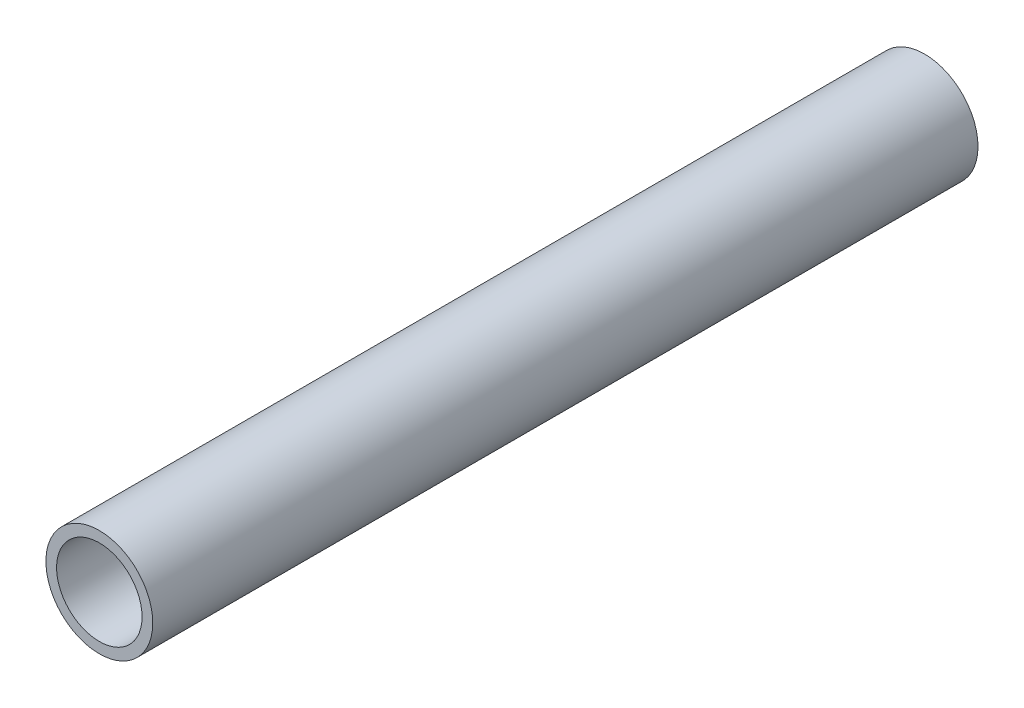
ISO-10303-21;
HEADER;
FILE_DESCRIPTION(('STEP AP214'),'2;1');
FILE_NAME('part.step','',(''),(''),'','','');
FILE_SCHEMA(('AUTOMOTIVE_DESIGN { 1 0 10303 214 1 1 1 1 }'));
ENDSEC;
DATA;
#1=APPLICATION_CONTEXT('core data for automotive mechanical design processes');
#2=APPLICATION_PROTOCOL_DEFINITION('international standard','automotive_design',2000,#1);
#3=PRODUCT_CONTEXT('',#1,'mechanical');
#4=PRODUCT('Part','Part','',(#3));
#5=PRODUCT_RELATED_PRODUCT_CATEGORY('part','',(#4));
#6=PRODUCT_DEFINITION_FORMATION('','',#4);
#7=PRODUCT_DEFINITION_CONTEXT('part definition',#1,'design');
#8=PRODUCT_DEFINITION('design','',#6,#7);
#9=PRODUCT_DEFINITION_SHAPE('','',#8);
#10=(LENGTH_UNIT() NAMED_UNIT(*) SI_UNIT(.MILLI.,.METRE.));
#11=(NAMED_UNIT(*) PLANE_ANGLE_UNIT() SI_UNIT($,.RADIAN.));
#12=(NAMED_UNIT(*) SI_UNIT($,.STERADIAN.) SOLID_ANGLE_UNIT());
#13=UNCERTAINTY_MEASURE_WITH_UNIT(LENGTH_MEASURE(1.E-05),#10,'distance_accuracy_value','');
#14=(GEOMETRIC_REPRESENTATION_CONTEXT(3) GLOBAL_UNCERTAINTY_ASSIGNED_CONTEXT((#13)) GLOBAL_UNIT_ASSIGNED_CONTEXT((#10,
#11,#12)) REPRESENTATION_CONTEXT('',''));
#15=CARTESIAN_POINT('',(0.,0.,0.));
#16=DIRECTION('',(0.,0.,1.));
#17=DIRECTION('',(1.,0.,0.));
#18=AXIS2_PLACEMENT_3D('',#15,#16,#17);
#19=CARTESIAN_POINT('',(0.,0.,19.31));
#20=DIRECTION('',(0.,0.,1.));
#21=DIRECTION('',(1.,0.,0.));
#22=AXIS2_PLACEMENT_3D('',#19,#20,#21);
#23=PLANE('',#22);
#24=CARTESIAN_POINT('',(0.,0.,19.31));
#25=DIRECTION('',(0.,0.,1.));
#26=DIRECTION('',(1.,0.,0.));
#27=AXIS2_PLACEMENT_3D('',#24,#25,#26);
#28=CIRCLE('',#27,1.25);
#29=CARTESIAN_POINT('',(1.25,0.,19.31));
#30=VERTEX_POINT('',#29);
#31=EDGE_CURVE('E10',#30,#30,#28,.T.);
#32=ORIENTED_EDGE('',*,*,#31,.T.);
#33=EDGE_LOOP('',(#32));
#34=FACE_BOUND('',#33,.T.);
#35=CARTESIAN_POINT('',(0.,0.,19.31));
#36=DIRECTION('',(0.,0.,1.));
#37=DIRECTION('',(1.,0.,0.));
#38=AXIS2_PLACEMENT_3D('',#35,#36,#37);
#39=CIRCLE('',#38,1.);
#40=CARTESIAN_POINT('',(1.,0.,19.31));
#41=VERTEX_POINT('',#40);
#42=EDGE_CURVE('E43',#41,#41,#39,.T.);
#43=ORIENTED_EDGE('',*,*,#42,.F.);
#44=EDGE_LOOP('',(#43));
#45=FACE_BOUND('',#44,.T.);
#46=ADVANCED_FACE('F32',(#34,#45),#23,.T.);
#47=CARTESIAN_POINT('',(0.,0.,0.));
#48=DIRECTION('',(0.,0.,1.));
#49=DIRECTION('',(1.,0.,0.));
#50=AXIS2_PLACEMENT_3D('',#47,#48,#49);
#51=PLANE('',#50);
#52=CARTESIAN_POINT('',(0.,0.,0.));
#53=DIRECTION('',(0.,0.,1.));
#54=DIRECTION('',(1.,0.,0.));
#55=AXIS2_PLACEMENT_3D('',#52,#53,#54);
#56=CIRCLE('',#55,1.25);
#57=CARTESIAN_POINT('',(1.25,0.,0.));
#58=VERTEX_POINT('',#57);
#59=EDGE_CURVE('E36',#58,#58,#56,.T.);
#60=ORIENTED_EDGE('',*,*,#59,.F.);
#61=EDGE_LOOP('',(#60));
#62=FACE_BOUND('',#61,.T.);
#63=CARTESIAN_POINT('',(0.,0.,0.));
#64=DIRECTION('',(0.,0.,1.));
#65=DIRECTION('',(1.,0.,0.));
#66=AXIS2_PLACEMENT_3D('',#63,#64,#65);
#67=CIRCLE('',#66,1.);
#68=CARTESIAN_POINT('',(1.,0.,0.));
#69=VERTEX_POINT('',#68);
#70=EDGE_CURVE('E45',#69,#69,#67,.T.);
#71=ORIENTED_EDGE('',*,*,#70,.T.);
#72=EDGE_LOOP('',(#71));
#73=FACE_BOUND('',#72,.T.);
#74=ADVANCED_FACE('F55',(#62,#73),#51,.F.);
#75=CARTESIAN_POINT('',(0.,0.,19.31));
#76=DIRECTION('',(0.,0.,-1.));
#77=DIRECTION('',(-1.,0.,0.));
#78=AXIS2_PLACEMENT_3D('',#75,#76,#77);
#79=CYLINDRICAL_SURFACE('',#78,1.25);
#80=ORIENTED_EDGE('',*,*,#31,.F.);
#81=EDGE_LOOP('',(#80));
#82=FACE_BOUND('',#81,.T.);
#83=ORIENTED_EDGE('',*,*,#59,.T.);
#84=EDGE_LOOP('',(#83));
#85=FACE_BOUND('',#84,.T.);
#86=ADVANCED_FACE('F34',(#82,#85),#79,.T.);
#87=CARTESIAN_POINT('',(0.,0.,19.31));
#88=DIRECTION('',(0.,0.,-1.));
#89=DIRECTION('',(-1.,0.,0.));
#90=AXIS2_PLACEMENT_3D('',#87,#88,#89);
#91=CYLINDRICAL_SURFACE('',#90,1.);
#92=ORIENTED_EDGE('',*,*,#42,.T.);
#93=EDGE_LOOP('',(#92));
#94=FACE_BOUND('',#93,.T.);
#95=ORIENTED_EDGE('',*,*,#70,.F.);
#96=EDGE_LOOP('',(#95));
#97=FACE_BOUND('',#96,.T.);
#98=ADVANCED_FACE('F51',(#94,#97),#91,.F.);
#99=CLOSED_SHELL('',(#46,#74,#86,#98));
#100=MANIFOLD_SOLID_BREP('B2',#99);
#101=ADVANCED_BREP_SHAPE_REPRESENTATION('',(#18,#100),#14);
#102=SHAPE_DEFINITION_REPRESENTATION(#9,#101);
ENDSEC;
END-ISO-10303-21;
